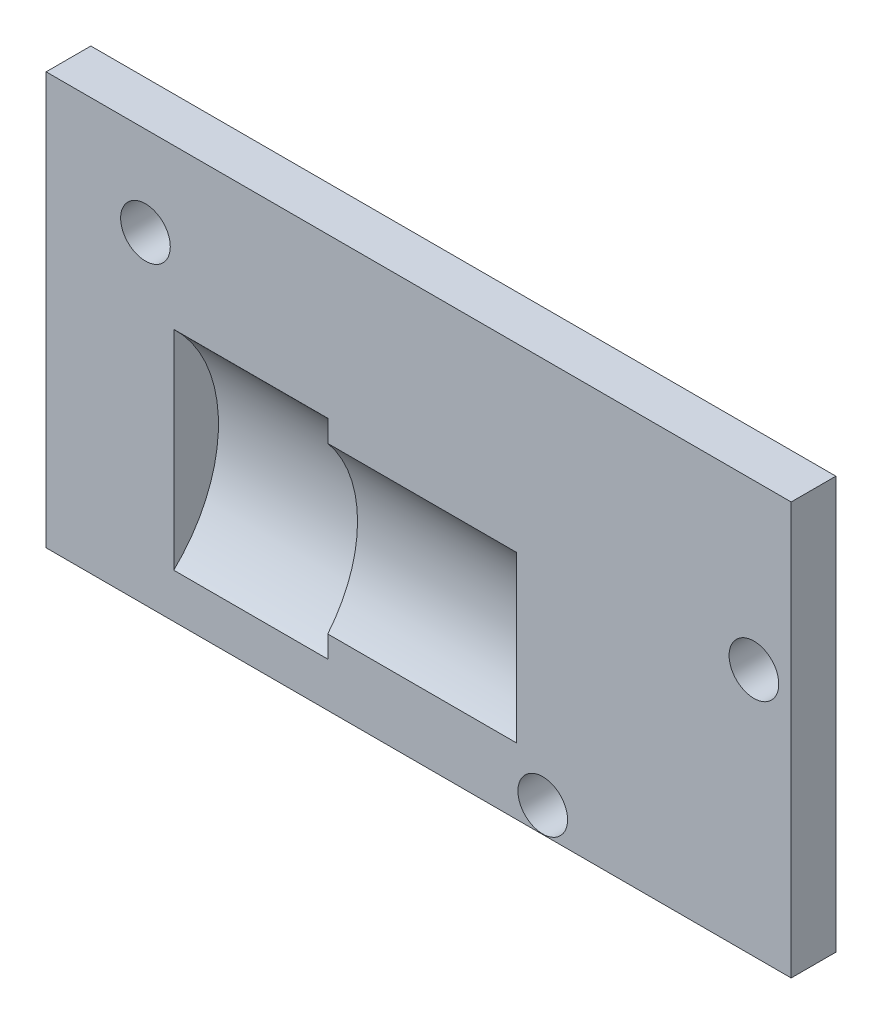
ISO-10303-21;
HEADER;
FILE_DESCRIPTION(('STEP AP214'),'2;1');
FILE_NAME('part.step','',(''),(''),'','','');
FILE_SCHEMA(('AUTOMOTIVE_DESIGN { 1 0 10303 214 1 1 1 1 }'));
ENDSEC;
DATA;
#1=APPLICATION_CONTEXT('core data for automotive mechanical design processes');
#2=APPLICATION_PROTOCOL_DEFINITION('international standard','automotive_design',2000,#1);
#3=PRODUCT_CONTEXT('',#1,'mechanical');
#4=PRODUCT('Part','Part','',(#3));
#5=PRODUCT_RELATED_PRODUCT_CATEGORY('part','',(#4));
#6=PRODUCT_DEFINITION_FORMATION('','',#4);
#7=PRODUCT_DEFINITION_CONTEXT('part definition',#1,'design');
#8=PRODUCT_DEFINITION('design','',#6,#7);
#9=PRODUCT_DEFINITION_SHAPE('','',#8);
#10=(LENGTH_UNIT() NAMED_UNIT(*) SI_UNIT(.MILLI.,.METRE.));
#11=(NAMED_UNIT(*) PLANE_ANGLE_UNIT() SI_UNIT($,.RADIAN.));
#12=(NAMED_UNIT(*) SI_UNIT($,.STERADIAN.) SOLID_ANGLE_UNIT());
#13=UNCERTAINTY_MEASURE_WITH_UNIT(LENGTH_MEASURE(1.E-05),#10,'distance_accuracy_value','');
#14=(GEOMETRIC_REPRESENTATION_CONTEXT(3) GLOBAL_UNCERTAINTY_ASSIGNED_CONTEXT((#13)) GLOBAL_UNIT_ASSIGNED_CONTEXT((#10,
#11,#12)) REPRESENTATION_CONTEXT('',''));
#15=CARTESIAN_POINT('',(0.,0.,0.));
#16=DIRECTION('',(0.,0.,1.));
#17=DIRECTION('',(1.,0.,0.));
#18=AXIS2_PLACEMENT_3D('',#15,#16,#17);
#19=CARTESIAN_POINT('',(0.,0.,0.9));
#20=DIRECTION('',(0.,0.,-1.));
#21=DIRECTION('',(-1.,0.,0.));
#22=AXIS2_PLACEMENT_3D('',#19,#20,#21);
#23=PLANE('',#22);
#24=CARTESIAN_POINT('',(2.49836109190227,-3.64,0.9));
#25=DIRECTION('',(0.,0.,1.));
#26=DIRECTION('',(1.,0.,0.));
#27=AXIS2_PLACEMENT_3D('',#24,#25,#26);
#28=CIRCLE('',#27,0.5);
#29=CARTESIAN_POINT('',(2.99836109190227,-3.64,0.9));
#30=VERTEX_POINT('',#29);
#31=EDGE_CURVE('E163',#30,#30,#28,.T.);
#32=ORIENTED_EDGE('',*,*,#31,.F.);
#33=EDGE_LOOP('',(#32));
#34=FACE_BOUND('',#33,.T.);
#35=CARTESIAN_POINT('',(6.75,0.850000000000003,0.9));
#36=DIRECTION('',(0.,0.,1.));
#37=DIRECTION('',(1.,0.,0.));
#38=AXIS2_PLACEMENT_3D('',#35,#36,#37);
#39=CIRCLE('',#38,0.500000000000001);
#40=CARTESIAN_POINT('',(7.25,0.850000000000003,0.9));
#41=VERTEX_POINT('',#40);
#42=EDGE_CURVE('E169',#41,#41,#39,.T.);
#43=ORIENTED_EDGE('',*,*,#42,.F.);
#44=EDGE_LOOP('',(#43));
#45=FACE_BOUND('',#44,.T.);
#46=CARTESIAN_POINT('',(-5.5,2.35,0.9));
#47=DIRECTION('',(0.,0.,1.));
#48=DIRECTION('',(1.,0.,0.));
#49=AXIS2_PLACEMENT_3D('',#46,#47,#48);
#50=CIRCLE('',#49,0.5);
#51=CARTESIAN_POINT('',(-5.,2.35,0.9));
#52=VERTEX_POINT('',#51);
#53=EDGE_CURVE('E175',#52,#52,#50,.T.);
#54=ORIENTED_EDGE('',*,*,#53,.F.);
#55=EDGE_LOOP('',(#54));
#56=FACE_BOUND('',#55,.T.);
#57=DIRECTION('',(0.,-1.,0.));
#58=VECTOR('',#57,1.);
#59=CARTESIAN_POINT('',(-7.5,4.15,0.9));
#60=LINE('',#59,#58);
#61=CARTESIAN_POINT('',(-7.5,4.15,0.9));
#62=VERTEX_POINT('',#61);
#63=CARTESIAN_POINT('',(-7.5,-4.15,0.9));
#64=VERTEX_POINT('',#63);
#65=EDGE_CURVE('E181',#62,#64,#60,.T.);
#66=ORIENTED_EDGE('',*,*,#65,.T.);
#67=DIRECTION('',(1.,0.,0.));
#68=VECTOR('',#67,1.);
#69=CARTESIAN_POINT('',(7.5,-4.15,0.9));
#70=LINE('',#69,#68);
#71=CARTESIAN_POINT('',(7.5,-4.15,0.9));
#72=VERTEX_POINT('',#71);
#73=EDGE_CURVE('E184',#64,#72,#70,.T.);
#74=ORIENTED_EDGE('',*,*,#73,.T.);
#75=DIRECTION('',(0.,1.,0.));
#76=VECTOR('',#75,1.);
#77=CARTESIAN_POINT('',(7.5,4.15,0.9));
#78=LINE('',#77,#76);
#79=CARTESIAN_POINT('',(7.5,4.15,0.9));
#80=VERTEX_POINT('',#79);
#81=EDGE_CURVE('E187',#72,#80,#78,.T.);
#82=ORIENTED_EDGE('',*,*,#81,.T.);
#83=DIRECTION('',(-1.,0.,0.));
#84=VECTOR('',#83,1.);
#85=CARTESIAN_POINT('',(7.5,4.15,0.9));
#86=LINE('',#85,#84);
#87=EDGE_CURVE('E189',#80,#62,#86,.T.);
#88=ORIENTED_EDGE('',*,*,#87,.T.);
#89=EDGE_LOOP('',(#66,#74,#82,#88));
#90=FACE_BOUND('',#89,.T.);
#91=DIRECTION('',(0.,1.,0.));
#92=VECTOR('',#91,1.);
#93=CARTESIAN_POINT('',(1.97,0.506324772583616,0.9));
#94=LINE('',#93,#92);
#95=CARTESIAN_POINT('',(1.97,-2.81632477258361,0.899999999999999));
#96=VERTEX_POINT('',#95);
#97=CARTESIAN_POINT('',(1.97,0.506324772583616,0.9));
#98=VERTEX_POINT('',#97);
#99=EDGE_CURVE('E122',#96,#98,#94,.T.);
#100=ORIENTED_EDGE('',*,*,#99,.F.);
#101=DIRECTION('',(-1.,0.,0.));
#102=VECTOR('',#101,1.);
#103=CARTESIAN_POINT('',(1.97,-2.81632477258361,0.899999999999999));
#104=LINE('',#103,#102);
#105=CARTESIAN_POINT('',(-1.83,-2.81632477258361,0.899999999999999));
#106=VERTEX_POINT('',#105);
#107=EDGE_CURVE('E113',#96,#106,#104,.T.);
#108=ORIENTED_EDGE('',*,*,#107,.T.);
#109=DIRECTION('',(0.,-1.,0.));
#110=VECTOR('',#109,1.);
#111=CARTESIAN_POINT('',(-1.83,0.945000000000001,0.899999999999999));
#112=LINE('',#111,#110);
#113=CARTESIAN_POINT('',(-1.83,-3.255,0.899999999999999));
#114=VERTEX_POINT('',#113);
#115=EDGE_CURVE('E136',#106,#114,#112,.T.);
#116=ORIENTED_EDGE('',*,*,#115,.T.);
#117=DIRECTION('',(-1.,0.,0.));
#118=VECTOR('',#117,1.);
#119=CARTESIAN_POINT('',(-1.83,-3.255,0.899999999999999));
#120=LINE('',#119,#118);
#121=CARTESIAN_POINT('',(-4.93,-3.255,0.899999999999999));
#122=VERTEX_POINT('',#121);
#123=EDGE_CURVE('E143',#114,#122,#120,.T.);
#124=ORIENTED_EDGE('',*,*,#123,.T.);
#125=DIRECTION('',(0.,-1.,0.));
#126=VECTOR('',#125,1.);
#127=CARTESIAN_POINT('',(-4.93,0.945,0.899999999999999));
#128=LINE('',#127,#126);
#129=CARTESIAN_POINT('',(-4.93,0.945000000000001,0.9));
#130=VERTEX_POINT('',#129);
#131=EDGE_CURVE('E131',#130,#122,#128,.T.);
#132=ORIENTED_EDGE('',*,*,#131,.F.);
#133=DIRECTION('',(-1.,0.,0.));
#134=VECTOR('',#133,1.);
#135=CARTESIAN_POINT('',(-1.83,0.945000000000001,0.9));
#136=LINE('',#135,#134);
#137=CARTESIAN_POINT('',(-1.83,0.945000000000001,0.9));
#138=VERTEX_POINT('',#137);
#139=EDGE_CURVE('E139',#138,#130,#136,.T.);
#140=ORIENTED_EDGE('',*,*,#139,.F.);
#141=CARTESIAN_POINT('',(-1.83,0.506324772583617,0.899999999999999));
#142=VERTEX_POINT('',#141);
#143=EDGE_CURVE('E133',#138,#142,#112,.T.);
#144=ORIENTED_EDGE('',*,*,#143,.T.);
#145=DIRECTION('',(-1.,0.,0.));
#146=VECTOR('',#145,1.);
#147=CARTESIAN_POINT('',(1.97,0.506324772583616,0.9));
#148=LINE('',#147,#146);
#149=EDGE_CURVE('E53',#98,#142,#148,.T.);
#150=ORIENTED_EDGE('',*,*,#149,.F.);
#151=EDGE_LOOP('',(#100,#108,#116,#124,#132,#140,#144,#150));
#152=FACE_BOUND('',#151,.T.);
#153=ADVANCED_FACE('F38',(#34,#45,#56,#90,#152),#23,.F.);
#154=CARTESIAN_POINT('',(0.,0.,0.));
#155=DIRECTION('',(0.,0.,-1.));
#156=DIRECTION('',(-1.,0.,0.));
#157=AXIS2_PLACEMENT_3D('',#154,#155,#156);
#158=PLANE('',#157);
#159=DIRECTION('',(0.,1.,0.));
#160=VECTOR('',#159,1.);
#161=CARTESIAN_POINT('',(2.77,0.650000000000001,0.));
#162=LINE('',#161,#160);
#163=CARTESIAN_POINT('',(2.77,-2.96,0.));
#164=VERTEX_POINT('',#163);
#165=CARTESIAN_POINT('',(2.77,0.650000000000001,0.));
#166=VERTEX_POINT('',#165);
#167=EDGE_CURVE('E149',#164,#166,#162,.T.);
#168=ORIENTED_EDGE('',*,*,#167,.T.);
#169=DIRECTION('',(-1.,0.,0.));
#170=VECTOR('',#169,1.);
#171=CARTESIAN_POINT('',(2.77,0.650000000000001,0.));
#172=LINE('',#171,#170);
#173=CARTESIAN_POINT('',(-5.63,0.65,0.));
#174=VERTEX_POINT('',#173);
#175=EDGE_CURVE('E157',#166,#174,#172,.T.);
#176=ORIENTED_EDGE('',*,*,#175,.T.);
#177=DIRECTION('',(0.,1.,0.));
#178=VECTOR('',#177,1.);
#179=CARTESIAN_POINT('',(-5.63,0.65,0.));
#180=LINE('',#179,#178);
#181=CARTESIAN_POINT('',(-5.63,-2.96,0.));
#182=VERTEX_POINT('',#181);
#183=EDGE_CURVE('E150',#182,#174,#180,.T.);
#184=ORIENTED_EDGE('',*,*,#183,.F.);
#185=DIRECTION('',(-1.,0.,0.));
#186=VECTOR('',#185,1.);
#187=CARTESIAN_POINT('',(2.77,-2.96,0.));
#188=LINE('',#187,#186);
#189=EDGE_CURVE('E153',#164,#182,#188,.T.);
#190=ORIENTED_EDGE('',*,*,#189,.F.);
#191=EDGE_LOOP('',(#168,#176,#184,#190));
#192=FACE_BOUND('',#191,.T.);
#193=CARTESIAN_POINT('',(6.75,0.850000000000003,0.));
#194=DIRECTION('',(0.,0.,1.));
#195=DIRECTION('',(1.,0.,0.));
#196=AXIS2_PLACEMENT_3D('',#193,#194,#195);
#197=CIRCLE('',#196,0.500000000000001);
#198=CARTESIAN_POINT('',(7.25,0.850000000000003,0.));
#199=VERTEX_POINT('',#198);
#200=EDGE_CURVE('E166',#199,#199,#197,.T.);
#201=ORIENTED_EDGE('',*,*,#200,.T.);
#202=EDGE_LOOP('',(#201));
#203=FACE_BOUND('',#202,.T.);
#204=DIRECTION('',(0.,-1.,0.));
#205=VECTOR('',#204,1.);
#206=CARTESIAN_POINT('',(-7.5,4.15,0.));
#207=LINE('',#206,#205);
#208=CARTESIAN_POINT('',(-7.5,4.15,0.));
#209=VERTEX_POINT('',#208);
#210=CARTESIAN_POINT('',(-7.5,-4.15,0.));
#211=VERTEX_POINT('',#210);
#212=EDGE_CURVE('E178',#209,#211,#207,.T.);
#213=ORIENTED_EDGE('',*,*,#212,.F.);
#214=DIRECTION('',(-1.,0.,0.));
#215=VECTOR('',#214,1.);
#216=CARTESIAN_POINT('',(7.5,4.15,0.));
#217=LINE('',#216,#215);
#218=CARTESIAN_POINT('',(7.5,4.15,0.));
#219=VERTEX_POINT('',#218);
#220=EDGE_CURVE('E185',#219,#209,#217,.T.);
#221=ORIENTED_EDGE('',*,*,#220,.F.);
#222=DIRECTION('',(0.,1.,0.));
#223=VECTOR('',#222,1.);
#224=CARTESIAN_POINT('',(7.5,4.15,0.));
#225=LINE('',#224,#223);
#226=CARTESIAN_POINT('',(7.5,-4.15,0.));
#227=VERTEX_POINT('',#226);
#228=EDGE_CURVE('E196',#227,#219,#225,.T.);
#229=ORIENTED_EDGE('',*,*,#228,.F.);
#230=DIRECTION('',(1.,0.,0.));
#231=VECTOR('',#230,1.);
#232=CARTESIAN_POINT('',(7.5,-4.15,0.));
#233=LINE('',#232,#231);
#234=EDGE_CURVE('E194',#211,#227,#233,.T.);
#235=ORIENTED_EDGE('',*,*,#234,.F.);
#236=EDGE_LOOP('',(#213,#221,#229,#235));
#237=FACE_BOUND('',#236,.T.);
#238=CARTESIAN_POINT('',(-5.5,2.35,0.));
#239=DIRECTION('',(0.,0.,1.));
#240=DIRECTION('',(1.,0.,0.));
#241=AXIS2_PLACEMENT_3D('',#238,#239,#240);
#242=CIRCLE('',#241,0.5);
#243=CARTESIAN_POINT('',(-5.,2.35,0.));
#244=VERTEX_POINT('',#243);
#245=EDGE_CURVE('E172',#244,#244,#242,.T.);
#246=ORIENTED_EDGE('',*,*,#245,.T.);
#247=EDGE_LOOP('',(#246));
#248=FACE_BOUND('',#247,.T.);
#249=CARTESIAN_POINT('',(2.49836109190227,-3.64,0.));
#250=DIRECTION('',(0.,0.,1.));
#251=DIRECTION('',(1.,0.,0.));
#252=AXIS2_PLACEMENT_3D('',#249,#250,#251);
#253=CIRCLE('',#252,0.5);
#254=CARTESIAN_POINT('',(2.99836109190227,-3.64,0.));
#255=VERTEX_POINT('',#254);
#256=EDGE_CURVE('E160',#255,#255,#253,.T.);
#257=ORIENTED_EDGE('',*,*,#256,.T.);
#258=EDGE_LOOP('',(#257));
#259=FACE_BOUND('',#258,.T.);
#260=ADVANCED_FACE('F214',(#192,#203,#237,#248,#259),#158,.T.);
#261=CARTESIAN_POINT('',(-7.5,4.15,0.9));
#262=DIRECTION('',(1.,0.,0.));
#263=DIRECTION('',(0.,1.,0.));
#264=AXIS2_PLACEMENT_3D('',#261,#262,#263);
#265=PLANE('',#264);
#266=ORIENTED_EDGE('',*,*,#212,.T.);
#267=DIRECTION('',(0.,0.,-1.));
#268=VECTOR('',#267,1.);
#269=CARTESIAN_POINT('',(-7.5,-4.15,0.9));
#270=LINE('',#269,#268);
#271=EDGE_CURVE('E11',#64,#211,#270,.T.);
#272=ORIENTED_EDGE('',*,*,#271,.F.);
#273=ORIENTED_EDGE('',*,*,#65,.F.);
#274=DIRECTION('',(0.,0.,-1.));
#275=VECTOR('',#274,1.);
#276=CARTESIAN_POINT('',(-7.5,4.15,0.9));
#277=LINE('',#276,#275);
#278=EDGE_CURVE('E191',#62,#209,#277,.T.);
#279=ORIENTED_EDGE('',*,*,#278,.T.);
#280=EDGE_LOOP('',(#266,#272,#273,#279));
#281=FACE_BOUND('',#280,.T.);
#282=ADVANCED_FACE('F40',(#281),#265,.F.);
#283=CARTESIAN_POINT('',(7.5,-4.15,0.9));
#284=DIRECTION('',(0.,1.,0.));
#285=DIRECTION('',(-1.,0.,0.));
#286=AXIS2_PLACEMENT_3D('',#283,#284,#285);
#287=PLANE('',#286);
#288=ORIENTED_EDGE('',*,*,#234,.T.);
#289=DIRECTION('',(0.,0.,-1.));
#290=VECTOR('',#289,1.);
#291=CARTESIAN_POINT('',(7.5,-4.15,0.9));
#292=LINE('',#291,#290);
#293=EDGE_CURVE('E46',#72,#227,#292,.T.);
#294=ORIENTED_EDGE('',*,*,#293,.F.);
#295=ORIENTED_EDGE('',*,*,#73,.F.);
#296=ORIENTED_EDGE('',*,*,#271,.T.);
#297=EDGE_LOOP('',(#288,#294,#295,#296));
#298=FACE_BOUND('',#297,.T.);
#299=ADVANCED_FACE('F224',(#298),#287,.F.);
#300=CARTESIAN_POINT('',(7.5,4.15,0.9));
#301=DIRECTION('',(-1.,0.,0.));
#302=DIRECTION('',(0.,0.,1.));
#303=AXIS2_PLACEMENT_3D('',#300,#301,#302);
#304=PLANE('',#303);
#305=ORIENTED_EDGE('',*,*,#228,.T.);
#306=DIRECTION('',(0.,0.,-1.));
#307=VECTOR('',#306,1.);
#308=CARTESIAN_POINT('',(7.5,4.15,0.9));
#309=LINE('',#308,#307);
#310=EDGE_CURVE('E201',#80,#219,#309,.T.);
#311=ORIENTED_EDGE('',*,*,#310,.F.);
#312=ORIENTED_EDGE('',*,*,#81,.F.);
#313=ORIENTED_EDGE('',*,*,#293,.T.);
#314=EDGE_LOOP('',(#305,#311,#312,#313));
#315=FACE_BOUND('',#314,.T.);
#316=ADVANCED_FACE('F208',(#315),#304,.F.);
#317=CARTESIAN_POINT('',(7.5,4.15,0.9));
#318=DIRECTION('',(0.,-1.,0.));
#319=DIRECTION('',(1.,0.,0.));
#320=AXIS2_PLACEMENT_3D('',#317,#318,#319);
#321=PLANE('',#320);
#322=ORIENTED_EDGE('',*,*,#220,.T.);
#323=ORIENTED_EDGE('',*,*,#278,.F.);
#324=ORIENTED_EDGE('',*,*,#87,.F.);
#325=ORIENTED_EDGE('',*,*,#310,.T.);
#326=EDGE_LOOP('',(#322,#323,#324,#325));
#327=FACE_BOUND('',#326,.T.);
#328=ADVANCED_FACE('F218',(#327),#321,.F.);
#329=CARTESIAN_POINT('',(-5.5,2.35,0.9));
#330=DIRECTION('',(0.,0.,-1.));
#331=DIRECTION('',(-1.,0.,0.));
#332=AXIS2_PLACEMENT_3D('',#329,#330,#331);
#333=CYLINDRICAL_SURFACE('',#332,0.5);
#334=ORIENTED_EDGE('',*,*,#53,.T.);
#335=EDGE_LOOP('',(#334));
#336=FACE_BOUND('',#335,.T.);
#337=ORIENTED_EDGE('',*,*,#245,.F.);
#338=EDGE_LOOP('',(#337));
#339=FACE_BOUND('',#338,.T.);
#340=ADVANCED_FACE('F242',(#336,#339),#333,.F.);
#341=CARTESIAN_POINT('',(6.75,0.850000000000003,0.9));
#342=DIRECTION('',(0.,0.,-1.));
#343=DIRECTION('',(-1.,0.,0.));
#344=AXIS2_PLACEMENT_3D('',#341,#342,#343);
#345=CYLINDRICAL_SURFACE('',#344,0.500000000000001);
#346=ORIENTED_EDGE('',*,*,#42,.T.);
#347=EDGE_LOOP('',(#346));
#348=FACE_BOUND('',#347,.T.);
#349=ORIENTED_EDGE('',*,*,#200,.F.);
#350=EDGE_LOOP('',(#349));
#351=FACE_BOUND('',#350,.T.);
#352=ADVANCED_FACE('F249',(#348,#351),#345,.F.);
#353=CARTESIAN_POINT('',(2.49836109190227,-3.64,0.9));
#354=DIRECTION('',(0.,0.,-1.));
#355=DIRECTION('',(-1.,0.,0.));
#356=AXIS2_PLACEMENT_3D('',#353,#354,#355);
#357=CYLINDRICAL_SURFACE('',#356,0.5);
#358=ORIENTED_EDGE('',*,*,#31,.T.);
#359=EDGE_LOOP('',(#358));
#360=FACE_BOUND('',#359,.T.);
#361=ORIENTED_EDGE('',*,*,#256,.F.);
#362=EDGE_LOOP('',(#361));
#363=FACE_BOUND('',#362,.T.);
#364=ADVANCED_FACE('F254',(#360,#363),#357,.F.);
#365=CARTESIAN_POINT('',(2.77,-1.155,2.99866220171596));
#366=DIRECTION('',(-1.,0.,0.));
#367=DIRECTION('',(0.,-1.,0.));
#368=AXIS2_PLACEMENT_3D('',#365,#366,#367);
#369=CYLINDRICAL_SURFACE('',#368,3.5);
#370=CARTESIAN_POINT('',(-5.63,-1.155,2.99866220171596));
#371=DIRECTION('',(-1.,0.,0.));
#372=DIRECTION('',(0.,1.,0.));
#373=AXIS2_PLACEMENT_3D('',#370,#371,#372);
#374=CIRCLE('',#373,3.5);
#375=EDGE_CURVE('E146',#174,#182,#374,.T.);
#376=ORIENTED_EDGE('',*,*,#375,.F.);
#377=ORIENTED_EDGE('',*,*,#175,.F.);
#378=CARTESIAN_POINT('',(2.77,-1.155,2.99866220171596));
#379=DIRECTION('',(-1.,0.,0.));
#380=DIRECTION('',(0.,1.,0.));
#381=AXIS2_PLACEMENT_3D('',#378,#379,#380);
#382=CIRCLE('',#381,3.5);
#383=EDGE_CURVE('E147',#166,#164,#382,.T.);
#384=ORIENTED_EDGE('',*,*,#383,.T.);
#385=ORIENTED_EDGE('',*,*,#189,.T.);
#386=EDGE_LOOP('',(#376,#377,#384,#385));
#387=FACE_BOUND('',#386,.T.);
#388=ADVANCED_FACE('F263',(#387),#369,.T.);
#389=CARTESIAN_POINT('',(2.77,-1.155,2.99866220171596));
#390=DIRECTION('',(1.,0.,0.));
#391=DIRECTION('',(0.,1.,0.));
#392=AXIS2_PLACEMENT_3D('',#389,#390,#391);
#393=PLANE('',#392);
#394=ORIENTED_EDGE('',*,*,#383,.F.);
#395=ORIENTED_EDGE('',*,*,#167,.F.);
#396=EDGE_LOOP('',(#394,#395));
#397=FACE_BOUND('',#396,.T.);
#398=ADVANCED_FACE('F269',(#397),#393,.T.);
#399=CARTESIAN_POINT('',(-5.63,-1.155,2.99866220171596));
#400=DIRECTION('',(1.,0.,0.));
#401=DIRECTION('',(0.,1.,0.));
#402=AXIS2_PLACEMENT_3D('',#399,#400,#401);
#403=PLANE('',#402);
#404=ORIENTED_EDGE('',*,*,#375,.T.);
#405=ORIENTED_EDGE('',*,*,#183,.T.);
#406=EDGE_LOOP('',(#404,#405));
#407=FACE_BOUND('',#406,.T.);
#408=ADVANCED_FACE('F273',(#407),#403,.F.);
#409=CARTESIAN_POINT('',(-1.83,-1.155,2.9));
#410=DIRECTION('',(-1.,0.,0.));
#411=DIRECTION('',(0.,-1.,0.));
#412=AXIS2_PLACEMENT_3D('',#409,#410,#411);
#413=CYLINDRICAL_SURFACE('',#412,2.9);
#414=CARTESIAN_POINT('',(-4.93,-1.155,2.9));
#415=DIRECTION('',(-1.,0.,0.));
#416=DIRECTION('',(0.,-1.,0.));
#417=AXIS2_PLACEMENT_3D('',#414,#415,#416);
#418=CIRCLE('',#417,2.9);
#419=EDGE_CURVE('E60',#130,#122,#418,.T.);
#420=ORIENTED_EDGE('',*,*,#419,.T.);
#421=ORIENTED_EDGE('',*,*,#123,.F.);
#422=CARTESIAN_POINT('',(-1.83,-1.155,2.9));
#423=DIRECTION('',(-1.,0.,0.));
#424=DIRECTION('',(0.,-1.,0.));
#425=AXIS2_PLACEMENT_3D('',#422,#423,#424);
#426=CIRCLE('',#425,2.9);
#427=EDGE_CURVE('E135',#138,#114,#426,.T.);
#428=ORIENTED_EDGE('',*,*,#427,.F.);
#429=ORIENTED_EDGE('',*,*,#139,.T.);
#430=EDGE_LOOP('',(#420,#421,#428,#429));
#431=FACE_BOUND('',#430,.T.);
#432=ADVANCED_FACE('F276',(#431),#413,.F.);
#433=CARTESIAN_POINT('',(-1.83,-1.155,2.9));
#434=DIRECTION('',(-1.,0.,0.));
#435=DIRECTION('',(0.,-1.,0.));
#436=AXIS2_PLACEMENT_3D('',#433,#434,#435);
#437=PLANE('',#436);
#438=CARTESIAN_POINT('',(-1.83,-1.155,2.9));
#439=DIRECTION('',(-1.,0.,0.));
#440=DIRECTION('',(0.,-1.,0.));
#441=AXIS2_PLACEMENT_3D('',#438,#439,#440);
#442=CIRCLE('',#441,2.6);
#443=EDGE_CURVE('E118',#142,#106,#442,.T.);
#444=ORIENTED_EDGE('',*,*,#443,.F.);
#445=ORIENTED_EDGE('',*,*,#143,.F.);
#446=ORIENTED_EDGE('',*,*,#427,.T.);
#447=ORIENTED_EDGE('',*,*,#115,.F.);
#448=EDGE_LOOP('',(#444,#445,#446,#447));
#449=FACE_BOUND('',#448,.T.);
#450=ADVANCED_FACE('F283',(#449),#437,.T.);
#451=CARTESIAN_POINT('',(-4.93,-1.155,2.9));
#452=DIRECTION('',(-1.,0.,0.));
#453=DIRECTION('',(0.,-1.,0.));
#454=AXIS2_PLACEMENT_3D('',#451,#452,#453);
#455=PLANE('',#454);
#456=ORIENTED_EDGE('',*,*,#131,.T.);
#457=ORIENTED_EDGE('',*,*,#419,.F.);
#458=EDGE_LOOP('',(#456,#457));
#459=FACE_BOUND('',#458,.T.);
#460=ADVANCED_FACE('F285',(#459),#455,.F.);
#461=CARTESIAN_POINT('',(1.97,-1.155,2.9));
#462=DIRECTION('',(-1.,0.,0.));
#463=DIRECTION('',(0.,-1.,0.));
#464=AXIS2_PLACEMENT_3D('',#461,#462,#463);
#465=CYLINDRICAL_SURFACE('',#464,2.6);
#466=ORIENTED_EDGE('',*,*,#443,.T.);
#467=ORIENTED_EDGE('',*,*,#107,.F.);
#468=CARTESIAN_POINT('',(1.97,-1.155,2.9));
#469=DIRECTION('',(-1.,0.,0.));
#470=DIRECTION('',(0.,-1.,0.));
#471=AXIS2_PLACEMENT_3D('',#468,#469,#470);
#472=CIRCLE('',#471,2.6);
#473=EDGE_CURVE('E116',#98,#96,#472,.T.);
#474=ORIENTED_EDGE('',*,*,#473,.F.);
#475=ORIENTED_EDGE('',*,*,#149,.T.);
#476=EDGE_LOOP('',(#466,#467,#474,#475));
#477=FACE_BOUND('',#476,.T.);
#478=ADVANCED_FACE('F115',(#477),#465,.F.);
#479=CARTESIAN_POINT('',(1.97,-1.155,2.9));
#480=DIRECTION('',(-1.,0.,0.));
#481=DIRECTION('',(0.,-1.,0.));
#482=AXIS2_PLACEMENT_3D('',#479,#480,#481);
#483=PLANE('',#482);
#484=ORIENTED_EDGE('',*,*,#473,.T.);
#485=ORIENTED_EDGE('',*,*,#99,.T.);
#486=EDGE_LOOP('',(#484,#485));
#487=FACE_BOUND('',#486,.T.);
#488=ADVANCED_FACE('F125',(#487),#483,.T.);
#489=CLOSED_SHELL('',(#153,#260,#282,#299,#316,#328,#340,#352,#364,#388,#398,#408,#432,#450,
#460,#478,#488));
#490=MANIFOLD_SOLID_BREP('B2',#489);
#491=ADVANCED_BREP_SHAPE_REPRESENTATION('',(#18,#490),#14);
#492=SHAPE_DEFINITION_REPRESENTATION(#9,#491);
ENDSEC;
END-ISO-10303-21;
